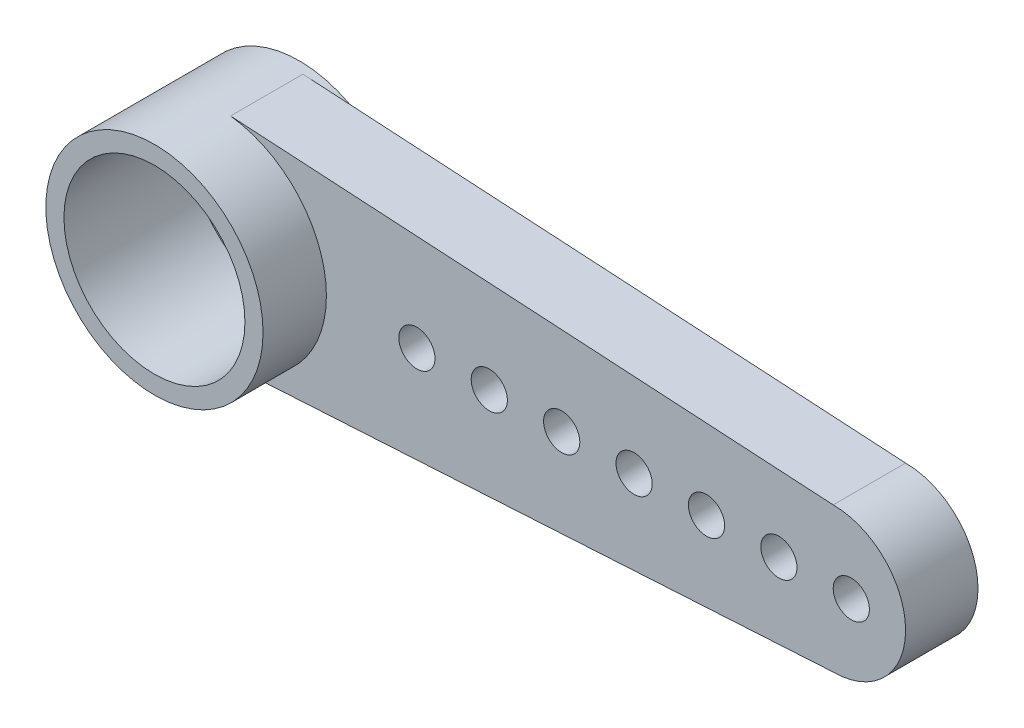
ISO-10303-21;
HEADER;
FILE_DESCRIPTION(('STEP AP214'),'2;1');
FILE_NAME('part.step','',(''),(''),'','','');
FILE_SCHEMA(('AUTOMOTIVE_DESIGN { 1 0 10303 214 1 1 1 1 }'));
ENDSEC;
DATA;
#1=APPLICATION_CONTEXT('core data for automotive mechanical design processes');
#2=APPLICATION_PROTOCOL_DEFINITION('international standard','automotive_design',2000,#1);
#3=PRODUCT_CONTEXT('',#1,'mechanical');
#4=PRODUCT('Part','Part','',(#3));
#5=PRODUCT_RELATED_PRODUCT_CATEGORY('part','',(#4));
#6=PRODUCT_DEFINITION_FORMATION('','',#4);
#7=PRODUCT_DEFINITION_CONTEXT('part definition',#1,'design');
#8=PRODUCT_DEFINITION('design','',#6,#7);
#9=PRODUCT_DEFINITION_SHAPE('','',#8);
#10=(LENGTH_UNIT() NAMED_UNIT(*) SI_UNIT(.MILLI.,.METRE.));
#11=(NAMED_UNIT(*) PLANE_ANGLE_UNIT() SI_UNIT($,.RADIAN.));
#12=(NAMED_UNIT(*) SI_UNIT($,.STERADIAN.) SOLID_ANGLE_UNIT());
#13=UNCERTAINTY_MEASURE_WITH_UNIT(LENGTH_MEASURE(1.E-05),#10,'distance_accuracy_value','');
#14=(GEOMETRIC_REPRESENTATION_CONTEXT(3) GLOBAL_UNCERTAINTY_ASSIGNED_CONTEXT((#13)) GLOBAL_UNIT_ASSIGNED_CONTEXT((#10,
#11,#12)) REPRESENTATION_CONTEXT('',''));
#15=CARTESIAN_POINT('',(0.,0.,0.));
#16=DIRECTION('',(0.,0.,1.));
#17=DIRECTION('',(1.,0.,0.));
#18=AXIS2_PLACEMENT_3D('',#15,#16,#17);
#19=CARTESIAN_POINT('',(0.,0.,4.));
#20=DIRECTION('',(0.,0.,-1.));
#21=DIRECTION('',(-1.,0.,0.));
#22=AXIS2_PLACEMENT_3D('',#19,#20,#21);
#23=CYLINDRICAL_SURFACE('',#22,1.25);
#24=CARTESIAN_POINT('',(0.,0.,0.25));
#25=DIRECTION('',(0.,0.,-1.));
#26=DIRECTION('',(-1.,0.,0.));
#27=AXIS2_PLACEMENT_3D('',#24,#25,#26);
#28=CIRCLE('',#27,1.25);
#29=CARTESIAN_POINT('',(-1.25,0.,0.25));
#30=VERTEX_POINT('',#29);
#31=EDGE_CURVE('E362',#30,#30,#28,.T.);
#32=ORIENTED_EDGE('',*,*,#31,.T.);
#33=EDGE_LOOP('',(#32));
#34=FACE_BOUND('',#33,.T.);
#35=CARTESIAN_POINT('',(0.,0.,0.5));
#36=DIRECTION('',(0.,0.,1.));
#37=DIRECTION('',(1.,0.,0.));
#38=AXIS2_PLACEMENT_3D('',#35,#36,#37);
#39=CIRCLE('',#38,1.25);
#40=CARTESIAN_POINT('',(1.25,0.,0.5));
#41=VERTEX_POINT('',#40);
#42=EDGE_CURVE('E43',#41,#41,#39,.F.);
#43=ORIENTED_EDGE('',*,*,#42,.F.);
#44=EDGE_LOOP('',(#43));
#45=FACE_BOUND('',#44,.T.);
#46=ADVANCED_FACE('F39',(#34,#45),#23,.F.);
#47=CARTESIAN_POINT('',(0.,0.,4.));
#48=DIRECTION('',(0.,0.,-1.));
#49=DIRECTION('',(-1.,0.,0.));
#50=AXIS2_PLACEMENT_3D('',#47,#48,#49);
#51=CYLINDRICAL_SURFACE('',#50,3.);
#52=CARTESIAN_POINT('',(0.,0.,2.25));
#53=DIRECTION('',(0.,0.,-1.));
#54=DIRECTION('',(-1.,0.,0.));
#55=AXIS2_PLACEMENT_3D('',#52,#53,#54);
#56=CIRCLE('',#55,3.);
#57=CARTESIAN_POINT('',(0.351724137931048,2.97931034482759,2.25));
#58=VERTEX_POINT('',#57);
#59=CARTESIAN_POINT('',(0.351724137931048,-2.97931034482759,2.25));
#60=VERTEX_POINT('',#59);
#61=EDGE_CURVE('E11',#58,#60,#56,.T.);
#62=ORIENTED_EDGE('',*,*,#61,.F.);
#63=DIRECTION('',(0.,0.,-1.));
#64=VECTOR('',#63,1.);
#65=CARTESIAN_POINT('',(0.351724137931024,2.97931034482759,4.));
#66=LINE('',#65,#64);
#67=CARTESIAN_POINT('',(0.351724137931048,2.97931034482759,0.25));
#68=VERTEX_POINT('',#67);
#69=EDGE_CURVE('E49',#58,#68,#66,.T.);
#70=ORIENTED_EDGE('',*,*,#69,.T.);
#71=CARTESIAN_POINT('',(0.,0.,0.25));
#72=DIRECTION('',(0.,0.,-1.));
#73=DIRECTION('',(-1.,0.,0.));
#74=AXIS2_PLACEMENT_3D('',#71,#72,#73);
#75=CIRCLE('',#74,3.);
#76=CARTESIAN_POINT('',(0.351724137931048,-2.97931034482759,0.25));
#77=VERTEX_POINT('',#76);
#78=EDGE_CURVE('E125',#68,#77,#75,.T.);
#79=ORIENTED_EDGE('',*,*,#78,.T.);
#80=DIRECTION('',(0.,0.,-1.));
#81=VECTOR('',#80,1.);
#82=CARTESIAN_POINT('',(0.351724137931024,-2.97931034482759,4.));
#83=LINE('',#82,#81);
#84=EDGE_CURVE('E121',#77,#60,#83,.F.);
#85=ORIENTED_EDGE('',*,*,#84,.T.);
#86=EDGE_LOOP('',(#62,#70,#79,#85));
#87=FACE_BOUND('',#86,.T.);
#88=CARTESIAN_POINT('',(0.,0.,0.));
#89=DIRECTION('',(0.,0.,1.));
#90=DIRECTION('',(1.,0.,0.));
#91=AXIS2_PLACEMENT_3D('',#88,#89,#90);
#92=CIRCLE('',#91,3.);
#93=CARTESIAN_POINT('',(3.,0.,0.));
#94=VERTEX_POINT('',#93);
#95=EDGE_CURVE('E114',#94,#94,#92,.T.);
#96=ORIENTED_EDGE('',*,*,#95,.T.);
#97=EDGE_LOOP('',(#96));
#98=FACE_BOUND('',#97,.T.);
#99=CARTESIAN_POINT('',(0.,0.,4.));
#100=DIRECTION('',(0.,0.,1.));
#101=DIRECTION('',(1.,0.,0.));
#102=AXIS2_PLACEMENT_3D('',#99,#100,#101);
#103=CIRCLE('',#102,3.);
#104=CARTESIAN_POINT('',(3.,0.,4.));
#105=VERTEX_POINT('',#104);
#106=EDGE_CURVE('E130',#105,#105,#103,.T.);
#107=ORIENTED_EDGE('',*,*,#106,.F.);
#108=EDGE_LOOP('',(#107));
#109=FACE_BOUND('',#108,.T.);
#110=ADVANCED_FACE('F41',(#87,#98,#109),#51,.T.);
#111=CARTESIAN_POINT('',(0.,0.,4.));
#112=DIRECTION('',(0.,0.,1.));
#113=DIRECTION('',(1.,0.,0.));
#114=AXIS2_PLACEMENT_3D('',#111,#112,#113);
#115=PLANE('',#114);
#116=CARTESIAN_POINT('',(0.,0.,4.));
#117=DIRECTION('',(0.,0.,1.));
#118=DIRECTION('',(1.,0.,0.));
#119=AXIS2_PLACEMENT_3D('',#116,#117,#118);
#120=CIRCLE('',#119,2.5);
#121=CARTESIAN_POINT('',(2.5,0.,4.));
#122=VERTEX_POINT('',#121);
#123=EDGE_CURVE('E356',#122,#122,#120,.T.);
#124=ORIENTED_EDGE('',*,*,#123,.F.);
#125=EDGE_LOOP('',(#124));
#126=FACE_BOUND('',#125,.T.);
#127=ORIENTED_EDGE('',*,*,#106,.T.);
#128=EDGE_LOOP('',(#127));
#129=FACE_BOUND('',#128,.T.);
#130=ADVANCED_FACE('F160',(#126,#129),#115,.T.);
#131=CARTESIAN_POINT('',(0.,0.,0.));
#132=DIRECTION('',(0.,0.,1.));
#133=DIRECTION('',(1.,0.,0.));
#134=AXIS2_PLACEMENT_3D('',#131,#132,#133);
#135=PLANE('',#134);
#136=CARTESIAN_POINT('',(0.,0.,0.));
#137=DIRECTION('',(0.,0.,-1.));
#138=DIRECTION('',(-1.,0.,0.));
#139=AXIS2_PLACEMENT_3D('',#136,#137,#138);
#140=CIRCLE('',#139,2.);
#141=CARTESIAN_POINT('',(-2.,0.,0.));
#142=VERTEX_POINT('',#141);
#143=EDGE_CURVE('E365',#142,#142,#140,.T.);
#144=ORIENTED_EDGE('',*,*,#143,.F.);
#145=EDGE_LOOP('',(#144));
#146=FACE_BOUND('',#145,.T.);
#147=ORIENTED_EDGE('',*,*,#95,.F.);
#148=EDGE_LOOP('',(#147));
#149=FACE_BOUND('',#148,.T.);
#150=ADVANCED_FACE('F157',(#146,#149),#135,.F.);
#151=CARTESIAN_POINT('',(17.,2.,2.25));
#152=DIRECTION('',(0.0587220219514704,0.998274373174996,0.));
#153=DIRECTION('',(-0.998274373174996,0.0587220219514704,0.));
#154=AXIS2_PLACEMENT_3D('',#151,#152,#153);
#155=PLANE('',#154);
#156=ORIENTED_EDGE('',*,*,#69,.F.);
#157=DIRECTION('',(0.998274373174996,-0.0587220219514704,0.));
#158=VECTOR('',#157,1.);
#159=CARTESIAN_POINT('',(17.,2.,2.25));
#160=LINE('',#159,#158);
#161=CARTESIAN_POINT('',(17.,2.,2.25));
#162=VERTEX_POINT('',#161);
#163=EDGE_CURVE('E90',#58,#162,#160,.T.);
#164=ORIENTED_EDGE('',*,*,#163,.T.);
#165=DIRECTION('',(0.,0.,-1.));
#166=VECTOR('',#165,1.);
#167=CARTESIAN_POINT('',(17.,2.,2.25));
#168=LINE('',#167,#166);
#169=CARTESIAN_POINT('',(17.,2.,0.25));
#170=VERTEX_POINT('',#169);
#171=EDGE_CURVE('E89',#162,#170,#168,.T.);
#172=ORIENTED_EDGE('',*,*,#171,.T.);
#173=DIRECTION('',(0.998274373174996,-0.0587220219514704,0.));
#174=VECTOR('',#173,1.);
#175=CARTESIAN_POINT('',(17.,2.,0.25));
#176=LINE('',#175,#174);
#177=EDGE_CURVE('E101',#68,#170,#176,.T.);
#178=ORIENTED_EDGE('',*,*,#177,.F.);
#179=EDGE_LOOP('',(#156,#164,#172,#178));
#180=FACE_BOUND('',#179,.T.);
#181=ADVANCED_FACE('F159',(#180),#155,.T.);
#182=CARTESIAN_POINT('',(17.,-2.,2.25));
#183=DIRECTION('',(0.0587220219514704,-0.998274373174996,0.));
#184=DIRECTION('',(0.998274373174996,0.0587220219514704,0.));
#185=AXIS2_PLACEMENT_3D('',#182,#183,#184);
#186=PLANE('',#185);
#187=ORIENTED_EDGE('',*,*,#84,.F.);
#188=DIRECTION('',(-0.998274373174996,-0.0587220219514704,0.));
#189=VECTOR('',#188,1.);
#190=CARTESIAN_POINT('',(17.,-2.,0.25));
#191=LINE('',#190,#189);
#192=CARTESIAN_POINT('',(17.,-2.,0.25));
#193=VERTEX_POINT('',#192);
#194=EDGE_CURVE('E56',#193,#77,#191,.T.);
#195=ORIENTED_EDGE('',*,*,#194,.F.);
#196=DIRECTION('',(0.,0.,-1.));
#197=VECTOR('',#196,1.);
#198=CARTESIAN_POINT('',(17.,-2.,2.25));
#199=LINE('',#198,#197);
#200=CARTESIAN_POINT('',(17.,-2.,2.25));
#201=VERTEX_POINT('',#200);
#202=EDGE_CURVE('E81',#201,#193,#199,.T.);
#203=ORIENTED_EDGE('',*,*,#202,.F.);
#204=DIRECTION('',(-0.998274373174996,-0.0587220219514704,0.));
#205=VECTOR('',#204,1.);
#206=CARTESIAN_POINT('',(17.,-2.,2.25));
#207=LINE('',#206,#205);
#208=EDGE_CURVE('E83',#201,#60,#207,.T.);
#209=ORIENTED_EDGE('',*,*,#208,.T.);
#210=EDGE_LOOP('',(#187,#195,#203,#209));
#211=FACE_BOUND('',#210,.T.);
#212=ADVANCED_FACE('F82',(#211),#186,.T.);
#213=CARTESIAN_POINT('',(17.,0.,2.25));
#214=DIRECTION('',(0.,0.,-1.));
#215=DIRECTION('',(-1.,0.,0.));
#216=AXIS2_PLACEMENT_3D('',#213,#214,#215);
#217=CYLINDRICAL_SURFACE('',#216,2.);
#218=CARTESIAN_POINT('',(17.,0.,0.25));
#219=DIRECTION('',(0.,0.,-1.));
#220=DIRECTION('',(-1.,0.,0.));
#221=AXIS2_PLACEMENT_3D('',#218,#219,#220);
#222=CIRCLE('',#221,2.);
#223=EDGE_CURVE('E109',#170,#193,#222,.T.);
#224=ORIENTED_EDGE('',*,*,#223,.F.);
#225=ORIENTED_EDGE('',*,*,#171,.F.);
#226=CARTESIAN_POINT('',(17.,0.,2.25));
#227=DIRECTION('',(0.,0.,-1.));
#228=DIRECTION('',(-1.,0.,0.));
#229=AXIS2_PLACEMENT_3D('',#226,#227,#228);
#230=CIRCLE('',#229,2.);
#231=EDGE_CURVE('E94',#162,#201,#230,.T.);
#232=ORIENTED_EDGE('',*,*,#231,.T.);
#233=ORIENTED_EDGE('',*,*,#202,.T.);
#234=EDGE_LOOP('',(#224,#225,#232,#233));
#235=FACE_BOUND('',#234,.T.);
#236=ADVANCED_FACE('F98',(#235),#217,.T.);
#237=CARTESIAN_POINT('',(17.,0.,2.25));
#238=DIRECTION('',(0.,0.,-1.));
#239=DIRECTION('',(-1.,0.,0.));
#240=AXIS2_PLACEMENT_3D('',#237,#238,#239);
#241=PLANE('',#240);
#242=CARTESIAN_POINT('',(5.49999999999999,0.,2.25));
#243=DIRECTION('',(0.,0.,-1.));
#244=DIRECTION('',(-1.,0.,0.));
#245=AXIS2_PLACEMENT_3D('',#242,#243,#244);
#246=CIRCLE('',#245,0.499999999999999);
#247=CARTESIAN_POINT('',(4.99999999999999,0.,2.25));
#248=VERTEX_POINT('',#247);
#249=EDGE_CURVE('E374',#248,#248,#246,.T.);
#250=ORIENTED_EDGE('',*,*,#249,.T.);
#251=EDGE_LOOP('',(#250));
#252=FACE_BOUND('',#251,.T.);
#253=CARTESIAN_POINT('',(7.49999999999999,0.,2.25));
#254=DIRECTION('',(0.,0.,-1.));
#255=DIRECTION('',(-1.,0.,0.));
#256=AXIS2_PLACEMENT_3D('',#253,#254,#255);
#257=CIRCLE('',#256,0.499999999999999);
#258=CARTESIAN_POINT('',(6.99999999999999,0.,2.25));
#259=VERTEX_POINT('',#258);
#260=EDGE_CURVE('E382',#259,#259,#257,.T.);
#261=ORIENTED_EDGE('',*,*,#260,.T.);
#262=EDGE_LOOP('',(#261));
#263=FACE_BOUND('',#262,.T.);
#264=CARTESIAN_POINT('',(9.49999999999999,0.,2.25));
#265=DIRECTION('',(0.,0.,-1.));
#266=DIRECTION('',(-1.,0.,0.));
#267=AXIS2_PLACEMENT_3D('',#264,#265,#266);
#268=CIRCLE('',#267,0.499999999999999);
#269=CARTESIAN_POINT('',(8.99999999999999,0.,2.25));
#270=VERTEX_POINT('',#269);
#271=EDGE_CURVE('E390',#270,#270,#268,.T.);
#272=ORIENTED_EDGE('',*,*,#271,.T.);
#273=EDGE_LOOP('',(#272));
#274=FACE_BOUND('',#273,.T.);
#275=CARTESIAN_POINT('',(11.5,0.,2.25));
#276=DIRECTION('',(0.,0.,-1.));
#277=DIRECTION('',(-1.,0.,0.));
#278=AXIS2_PLACEMENT_3D('',#275,#276,#277);
#279=CIRCLE('',#278,0.499999999999999);
#280=CARTESIAN_POINT('',(11.,0.,2.25));
#281=VERTEX_POINT('',#280);
#282=EDGE_CURVE('E398',#281,#281,#279,.T.);
#283=ORIENTED_EDGE('',*,*,#282,.T.);
#284=EDGE_LOOP('',(#283));
#285=FACE_BOUND('',#284,.T.);
#286=CARTESIAN_POINT('',(13.5,0.,2.25));
#287=DIRECTION('',(0.,0.,-1.));
#288=DIRECTION('',(-1.,0.,0.));
#289=AXIS2_PLACEMENT_3D('',#286,#287,#288);
#290=CIRCLE('',#289,0.499999999999999);
#291=CARTESIAN_POINT('',(13.,0.,2.25));
#292=VERTEX_POINT('',#291);
#293=EDGE_CURVE('E406',#292,#292,#290,.T.);
#294=ORIENTED_EDGE('',*,*,#293,.T.);
#295=EDGE_LOOP('',(#294));
#296=FACE_BOUND('',#295,.T.);
#297=CARTESIAN_POINT('',(15.5,0.,2.25));
#298=DIRECTION('',(0.,0.,-1.));
#299=DIRECTION('',(-1.,0.,0.));
#300=AXIS2_PLACEMENT_3D('',#297,#298,#299);
#301=CIRCLE('',#300,0.499999999999997);
#302=CARTESIAN_POINT('',(15.,0.,2.25));
#303=VERTEX_POINT('',#302);
#304=EDGE_CURVE('E414',#303,#303,#301,.T.);
#305=ORIENTED_EDGE('',*,*,#304,.T.);
#306=EDGE_LOOP('',(#305));
#307=FACE_BOUND('',#306,.T.);
#308=CARTESIAN_POINT('',(17.5,0.,2.25));
#309=DIRECTION('',(0.,0.,-1.));
#310=DIRECTION('',(-1.,0.,0.));
#311=AXIS2_PLACEMENT_3D('',#308,#309,#310);
#312=CIRCLE('',#311,0.499999999999999);
#313=CARTESIAN_POINT('',(17.,0.,2.25));
#314=VERTEX_POINT('',#313);
#315=EDGE_CURVE('E112',#314,#314,#312,.T.);
#316=ORIENTED_EDGE('',*,*,#315,.T.);
#317=EDGE_LOOP('',(#316));
#318=FACE_BOUND('',#317,.T.);
#319=ORIENTED_EDGE('',*,*,#163,.F.);
#320=ORIENTED_EDGE('',*,*,#61,.T.);
#321=ORIENTED_EDGE('',*,*,#208,.F.);
#322=ORIENTED_EDGE('',*,*,#231,.F.);
#323=EDGE_LOOP('',(#319,#320,#321,#322));
#324=FACE_BOUND('',#323,.T.);
#325=ADVANCED_FACE('F93',(#252,#263,#274,#285,#296,#307,#318,#324),#241,.F.);
#326=CARTESIAN_POINT('',(17.,0.,0.25));
#327=DIRECTION('',(0.,0.,-1.));
#328=DIRECTION('',(-1.,0.,0.));
#329=AXIS2_PLACEMENT_3D('',#326,#327,#328);
#330=PLANE('',#329);
#331=ORIENTED_EDGE('',*,*,#78,.F.);
#332=ORIENTED_EDGE('',*,*,#177,.T.);
#333=ORIENTED_EDGE('',*,*,#223,.T.);
#334=ORIENTED_EDGE('',*,*,#194,.T.);
#335=EDGE_LOOP('',(#331,#332,#333,#334));
#336=FACE_BOUND('',#335,.T.);
#337=CARTESIAN_POINT('',(5.49999999999999,0.,0.25));
#338=DIRECTION('',(0.,0.,-1.));
#339=DIRECTION('',(-1.,0.,0.));
#340=AXIS2_PLACEMENT_3D('',#337,#338,#339);
#341=CIRCLE('',#340,0.499999999999999);
#342=CARTESIAN_POINT('',(4.99999999999999,0.,0.25));
#343=VERTEX_POINT('',#342);
#344=EDGE_CURVE('E370',#343,#343,#341,.T.);
#345=ORIENTED_EDGE('',*,*,#344,.F.);
#346=EDGE_LOOP('',(#345));
#347=FACE_BOUND('',#346,.T.);
#348=CARTESIAN_POINT('',(7.49999999999999,0.,0.25));
#349=DIRECTION('',(0.,0.,-1.));
#350=DIRECTION('',(-1.,0.,0.));
#351=AXIS2_PLACEMENT_3D('',#348,#349,#350);
#352=CIRCLE('',#351,0.499999999999999);
#353=CARTESIAN_POINT('',(6.99999999999999,0.,0.25));
#354=VERTEX_POINT('',#353);
#355=EDGE_CURVE('E378',#354,#354,#352,.T.);
#356=ORIENTED_EDGE('',*,*,#355,.F.);
#357=EDGE_LOOP('',(#356));
#358=FACE_BOUND('',#357,.T.);
#359=CARTESIAN_POINT('',(9.49999999999999,0.,0.25));
#360=DIRECTION('',(0.,0.,-1.));
#361=DIRECTION('',(-1.,0.,0.));
#362=AXIS2_PLACEMENT_3D('',#359,#360,#361);
#363=CIRCLE('',#362,0.499999999999999);
#364=CARTESIAN_POINT('',(8.99999999999999,0.,0.25));
#365=VERTEX_POINT('',#364);
#366=EDGE_CURVE('E386',#365,#365,#363,.T.);
#367=ORIENTED_EDGE('',*,*,#366,.F.);
#368=EDGE_LOOP('',(#367));
#369=FACE_BOUND('',#368,.T.);
#370=CARTESIAN_POINT('',(11.5,0.,0.25));
#371=DIRECTION('',(0.,0.,-1.));
#372=DIRECTION('',(-1.,0.,0.));
#373=AXIS2_PLACEMENT_3D('',#370,#371,#372);
#374=CIRCLE('',#373,0.499999999999999);
#375=CARTESIAN_POINT('',(11.,0.,0.25));
#376=VERTEX_POINT('',#375);
#377=EDGE_CURVE('E394',#376,#376,#374,.T.);
#378=ORIENTED_EDGE('',*,*,#377,.F.);
#379=EDGE_LOOP('',(#378));
#380=FACE_BOUND('',#379,.T.);
#381=CARTESIAN_POINT('',(13.5,0.,0.25));
#382=DIRECTION('',(0.,0.,-1.));
#383=DIRECTION('',(-1.,0.,0.));
#384=AXIS2_PLACEMENT_3D('',#381,#382,#383);
#385=CIRCLE('',#384,0.499999999999999);
#386=CARTESIAN_POINT('',(13.,0.,0.25));
#387=VERTEX_POINT('',#386);
#388=EDGE_CURVE('E402',#387,#387,#385,.T.);
#389=ORIENTED_EDGE('',*,*,#388,.F.);
#390=EDGE_LOOP('',(#389));
#391=FACE_BOUND('',#390,.T.);
#392=CARTESIAN_POINT('',(15.5,0.,0.25));
#393=DIRECTION('',(0.,0.,-1.));
#394=DIRECTION('',(-1.,0.,0.));
#395=AXIS2_PLACEMENT_3D('',#392,#393,#394);
#396=CIRCLE('',#395,0.499999999999997);
#397=CARTESIAN_POINT('',(15.,0.,0.25));
#398=VERTEX_POINT('',#397);
#399=EDGE_CURVE('E410',#398,#398,#396,.T.);
#400=ORIENTED_EDGE('',*,*,#399,.F.);
#401=EDGE_LOOP('',(#400));
#402=FACE_BOUND('',#401,.T.);
#403=CARTESIAN_POINT('',(17.5,0.,0.25));
#404=DIRECTION('',(0.,0.,-1.));
#405=DIRECTION('',(-1.,0.,0.));
#406=AXIS2_PLACEMENT_3D('',#403,#404,#405);
#407=CIRCLE('',#406,0.499999999999999);
#408=CARTESIAN_POINT('',(17.,0.,0.25));
#409=VERTEX_POINT('',#408);
#410=EDGE_CURVE('E107',#409,#409,#407,.T.);
#411=ORIENTED_EDGE('',*,*,#410,.F.);
#412=EDGE_LOOP('',(#411));
#413=FACE_BOUND('',#412,.T.);
#414=ADVANCED_FACE('F220',(#336,#347,#358,#369,#380,#391,#402,#413),#330,.T.);
#415=CARTESIAN_POINT('',(17.5,0.,2.25));
#416=DIRECTION('',(0.,0.,-1.));
#417=DIRECTION('',(-1.,0.,0.));
#418=AXIS2_PLACEMENT_3D('',#415,#416,#417);
#419=CYLINDRICAL_SURFACE('',#418,0.499999999999999);
#420=ORIENTED_EDGE('',*,*,#315,.F.);
#421=EDGE_LOOP('',(#420));
#422=FACE_BOUND('',#421,.T.);
#423=ORIENTED_EDGE('',*,*,#410,.T.);
#424=EDGE_LOOP('',(#423));
#425=FACE_BOUND('',#424,.T.);
#426=ADVANCED_FACE('F216',(#422,#425),#419,.F.);
#427=CARTESIAN_POINT('',(15.5,0.,2.25));
#428=DIRECTION('',(0.,0.,-1.));
#429=DIRECTION('',(-1.,0.,0.));
#430=AXIS2_PLACEMENT_3D('',#427,#428,#429);
#431=CYLINDRICAL_SURFACE('',#430,0.499999999999997);
#432=ORIENTED_EDGE('',*,*,#304,.F.);
#433=EDGE_LOOP('',(#432));
#434=FACE_BOUND('',#433,.T.);
#435=ORIENTED_EDGE('',*,*,#399,.T.);
#436=EDGE_LOOP('',(#435));
#437=FACE_BOUND('',#436,.T.);
#438=ADVANCED_FACE('F212',(#434,#437),#431,.F.);
#439=CARTESIAN_POINT('',(13.5,0.,2.25));
#440=DIRECTION('',(0.,0.,-1.));
#441=DIRECTION('',(-1.,0.,0.));
#442=AXIS2_PLACEMENT_3D('',#439,#440,#441);
#443=CYLINDRICAL_SURFACE('',#442,0.499999999999999);
#444=ORIENTED_EDGE('',*,*,#293,.F.);
#445=EDGE_LOOP('',(#444));
#446=FACE_BOUND('',#445,.T.);
#447=ORIENTED_EDGE('',*,*,#388,.T.);
#448=EDGE_LOOP('',(#447));
#449=FACE_BOUND('',#448,.T.);
#450=ADVANCED_FACE('F208',(#446,#449),#443,.F.);
#451=CARTESIAN_POINT('',(11.5,0.,2.25));
#452=DIRECTION('',(0.,0.,-1.));
#453=DIRECTION('',(-1.,0.,0.));
#454=AXIS2_PLACEMENT_3D('',#451,#452,#453);
#455=CYLINDRICAL_SURFACE('',#454,0.499999999999999);
#456=ORIENTED_EDGE('',*,*,#282,.F.);
#457=EDGE_LOOP('',(#456));
#458=FACE_BOUND('',#457,.T.);
#459=ORIENTED_EDGE('',*,*,#377,.T.);
#460=EDGE_LOOP('',(#459));
#461=FACE_BOUND('',#460,.T.);
#462=ADVANCED_FACE('F204',(#458,#461),#455,.F.);
#463=CARTESIAN_POINT('',(9.49999999999999,0.,2.25));
#464=DIRECTION('',(0.,0.,-1.));
#465=DIRECTION('',(-1.,0.,0.));
#466=AXIS2_PLACEMENT_3D('',#463,#464,#465);
#467=CYLINDRICAL_SURFACE('',#466,0.499999999999999);
#468=ORIENTED_EDGE('',*,*,#271,.F.);
#469=EDGE_LOOP('',(#468));
#470=FACE_BOUND('',#469,.T.);
#471=ORIENTED_EDGE('',*,*,#366,.T.);
#472=EDGE_LOOP('',(#471));
#473=FACE_BOUND('',#472,.T.);
#474=ADVANCED_FACE('F200',(#470,#473),#467,.F.);
#475=CARTESIAN_POINT('',(7.49999999999999,0.,2.25));
#476=DIRECTION('',(0.,0.,-1.));
#477=DIRECTION('',(-1.,0.,0.));
#478=AXIS2_PLACEMENT_3D('',#475,#476,#477);
#479=CYLINDRICAL_SURFACE('',#478,0.499999999999999);
#480=ORIENTED_EDGE('',*,*,#260,.F.);
#481=EDGE_LOOP('',(#480));
#482=FACE_BOUND('',#481,.T.);
#483=ORIENTED_EDGE('',*,*,#355,.T.);
#484=EDGE_LOOP('',(#483));
#485=FACE_BOUND('',#484,.T.);
#486=ADVANCED_FACE('F196',(#482,#485),#479,.F.);
#487=CARTESIAN_POINT('',(5.49999999999999,0.,2.25));
#488=DIRECTION('',(0.,0.,-1.));
#489=DIRECTION('',(-1.,0.,0.));
#490=AXIS2_PLACEMENT_3D('',#487,#488,#489);
#491=CYLINDRICAL_SURFACE('',#490,0.499999999999999);
#492=ORIENTED_EDGE('',*,*,#249,.F.);
#493=EDGE_LOOP('',(#492));
#494=FACE_BOUND('',#493,.T.);
#495=ORIENTED_EDGE('',*,*,#344,.T.);
#496=EDGE_LOOP('',(#495));
#497=FACE_BOUND('',#496,.T.);
#498=ADVANCED_FACE('F192',(#494,#497),#491,.F.);
#499=CARTESIAN_POINT('',(0.,0.,0.25));
#500=DIRECTION('',(0.,0.,-1.));
#501=DIRECTION('',(-1.,0.,0.));
#502=AXIS2_PLACEMENT_3D('',#499,#500,#501);
#503=CYLINDRICAL_SURFACE('',#502,2.);
#504=CARTESIAN_POINT('',(0.,0.,0.25));
#505=DIRECTION('',(0.,0.,-1.));
#506=DIRECTION('',(-1.,0.,0.));
#507=AXIS2_PLACEMENT_3D('',#504,#505,#506);
#508=CIRCLE('',#507,2.);
#509=CARTESIAN_POINT('',(-2.,0.,0.25));
#510=VERTEX_POINT('',#509);
#511=EDGE_CURVE('E366',#510,#510,#508,.T.);
#512=ORIENTED_EDGE('',*,*,#511,.F.);
#513=EDGE_LOOP('',(#512));
#514=FACE_BOUND('',#513,.T.);
#515=ORIENTED_EDGE('',*,*,#143,.T.);
#516=EDGE_LOOP('',(#515));
#517=FACE_BOUND('',#516,.T.);
#518=ADVANCED_FACE('F188',(#514,#517),#503,.F.);
#519=CARTESIAN_POINT('',(0.,0.,0.25));
#520=DIRECTION('',(0.,0.,-1.));
#521=DIRECTION('',(-1.,0.,0.));
#522=AXIS2_PLACEMENT_3D('',#519,#520,#521);
#523=PLANE('',#522);
#524=ORIENTED_EDGE('',*,*,#31,.F.);
#525=EDGE_LOOP('',(#524));
#526=FACE_BOUND('',#525,.T.);
#527=ORIENTED_EDGE('',*,*,#511,.T.);
#528=EDGE_LOOP('',(#527));
#529=FACE_BOUND('',#528,.T.);
#530=ADVANCED_FACE('F184',(#526,#529),#523,.T.);
#531=CARTESIAN_POINT('',(0.,0.,0.5));
#532=DIRECTION('',(0.,0.,1.));
#533=DIRECTION('',(1.,0.,0.));
#534=AXIS2_PLACEMENT_3D('',#531,#532,#533);
#535=PLANE('',#534);
#536=CARTESIAN_POINT('',(0.,0.,0.5));
#537=DIRECTION('',(0.,0.,1.));
#538=DIRECTION('',(1.,0.,0.));
#539=AXIS2_PLACEMENT_3D('',#536,#537,#538);
#540=CIRCLE('',#539,2.5);
#541=CARTESIAN_POINT('',(2.5,0.,0.5));
#542=VERTEX_POINT('',#541);
#543=EDGE_CURVE('E353',#542,#542,#540,.T.);
#544=ORIENTED_EDGE('',*,*,#543,.T.);
#545=EDGE_LOOP('',(#544));
#546=FACE_BOUND('',#545,.T.);
#547=ORIENTED_EDGE('',*,*,#42,.T.);
#548=EDGE_LOOP('',(#547));
#549=FACE_BOUND('',#548,.T.);
#550=ADVANCED_FACE('F187',(#546,#549),#535,.T.);
#551=CARTESIAN_POINT('',(0.,0.,0.5));
#552=DIRECTION('',(0.,0.,1.));
#553=DIRECTION('',(1.,0.,0.));
#554=AXIS2_PLACEMENT_3D('',#551,#552,#553);
#555=CYLINDRICAL_SURFACE('',#554,2.5);
#556=ORIENTED_EDGE('',*,*,#543,.F.);
#557=EDGE_LOOP('',(#556));
#558=FACE_BOUND('',#557,.T.);
#559=ORIENTED_EDGE('',*,*,#123,.T.);
#560=EDGE_LOOP('',(#559));
#561=FACE_BOUND('',#560,.T.);
#562=ADVANCED_FACE('F182',(#558,#561),#555,.F.);
#563=CLOSED_SHELL('',(#46,#110,#130,#150,#181,#212,#236,#325,#414,#426,#438,#450,#462,#474,#486,
#498,#518,#530,#550,#562));
#564=MANIFOLD_SOLID_BREP('B2',#563);
#565=ADVANCED_BREP_SHAPE_REPRESENTATION('',(#18,#564),#14);
#566=SHAPE_DEFINITION_REPRESENTATION(#9,#565);
ENDSEC;
END-ISO-10303-21;
